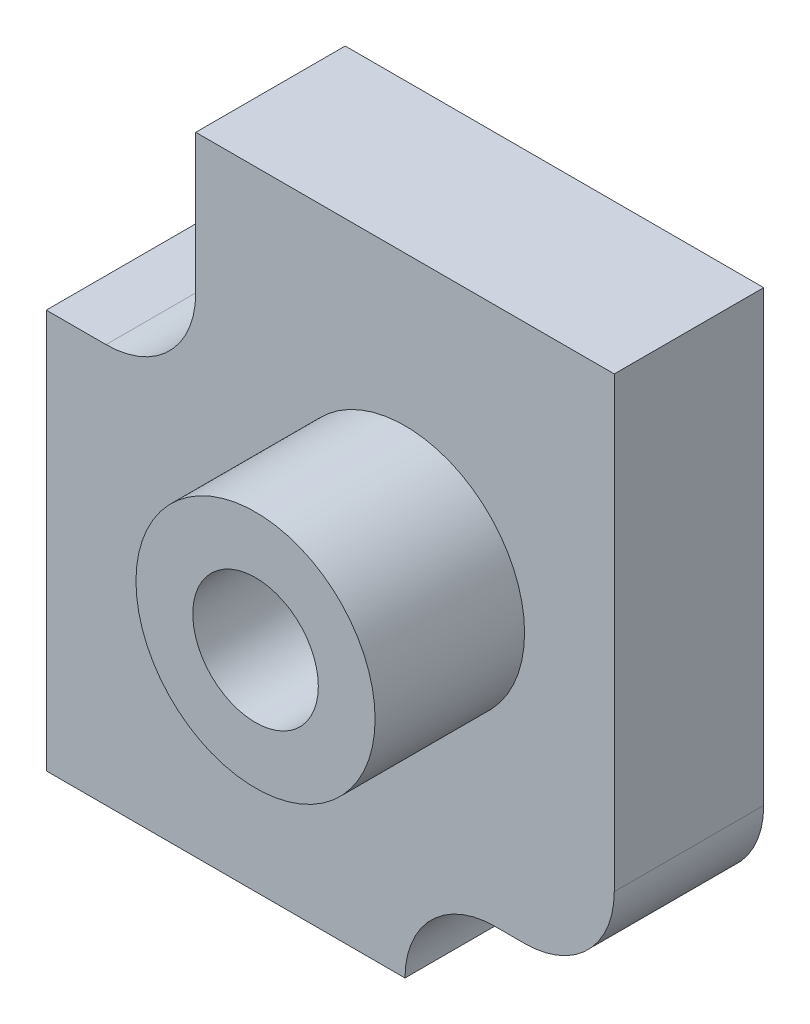
ISO-10303-21;
HEADER;
FILE_DESCRIPTION(('STEP AP214'),'2;1');
FILE_NAME('part.step','',(''),(''),'','','');
FILE_SCHEMA(('AUTOMOTIVE_DESIGN { 1 0 10303 214 1 1 1 1 }'));
ENDSEC;
DATA;
#1=APPLICATION_CONTEXT('core data for automotive mechanical design processes');
#2=APPLICATION_PROTOCOL_DEFINITION('international standard','automotive_design',2000,#1);
#3=PRODUCT_CONTEXT('',#1,'mechanical');
#4=PRODUCT('Part','Part','',(#3));
#5=PRODUCT_RELATED_PRODUCT_CATEGORY('part','',(#4));
#6=PRODUCT_DEFINITION_FORMATION('','',#4);
#7=PRODUCT_DEFINITION_CONTEXT('part definition',#1,'design');
#8=PRODUCT_DEFINITION('design','',#6,#7);
#9=PRODUCT_DEFINITION_SHAPE('','',#8);
#10=(LENGTH_UNIT() NAMED_UNIT(*) SI_UNIT(.MILLI.,.METRE.));
#11=(NAMED_UNIT(*) PLANE_ANGLE_UNIT() SI_UNIT($,.RADIAN.));
#12=(NAMED_UNIT(*) SI_UNIT($,.STERADIAN.) SOLID_ANGLE_UNIT());
#13=UNCERTAINTY_MEASURE_WITH_UNIT(LENGTH_MEASURE(1.E-05),#10,'distance_accuracy_value','');
#14=(GEOMETRIC_REPRESENTATION_CONTEXT(3) GLOBAL_UNCERTAINTY_ASSIGNED_CONTEXT((#13)) GLOBAL_UNIT_ASSIGNED_CONTEXT((#10,
#11,#12)) REPRESENTATION_CONTEXT('',''));
#15=CARTESIAN_POINT('',(0.,0.,0.));
#16=DIRECTION('',(0.,0.,1.));
#17=DIRECTION('',(1.,0.,0.));
#18=AXIS2_PLACEMENT_3D('',#15,#16,#17);
#19=CARTESIAN_POINT('',(-7.,9.,5.));
#20=DIRECTION('',(1.,0.,0.));
#21=DIRECTION('',(0.,0.,-1.));
#22=AXIS2_PLACEMENT_3D('',#19,#20,#21);
#23=PLANE('',#22);
#24=DIRECTION('',(0.,-1.,0.));
#25=VECTOR('',#24,1.);
#26=CARTESIAN_POINT('',(-7.,9.,0.));
#27=LINE('',#26,#25);
#28=CARTESIAN_POINT('',(-7.,9.,0.));
#29=VERTEX_POINT('',#28);
#30=CARTESIAN_POINT('',(-7.,4.34897785434163,0.));
#31=VERTEX_POINT('',#30);
#32=EDGE_CURVE('E154',#29,#31,#27,.T.);
#33=ORIENTED_EDGE('',*,*,#32,.T.);
#34=DIRECTION('',(0.,0.,-1.));
#35=VECTOR('',#34,1.);
#36=CARTESIAN_POINT('',(-7.,4.34897785434163,5.));
#37=LINE('',#36,#35);
#38=CARTESIAN_POINT('',(-7.,4.34897785434163,5.));
#39=VERTEX_POINT('',#38);
#40=EDGE_CURVE('E56',#31,#39,#37,.F.);
#41=ORIENTED_EDGE('',*,*,#40,.T.);
#42=DIRECTION('',(0.,-1.,0.));
#43=VECTOR('',#42,1.);
#44=CARTESIAN_POINT('',(-7.,9.,5.));
#45=LINE('',#44,#43);
#46=CARTESIAN_POINT('',(-7.,9.,5.));
#47=VERTEX_POINT('',#46);
#48=EDGE_CURVE('E157',#47,#39,#45,.T.);
#49=ORIENTED_EDGE('',*,*,#48,.F.);
#50=DIRECTION('',(0.,0.,-1.));
#51=VECTOR('',#50,1.);
#52=CARTESIAN_POINT('',(-7.,9.,5.));
#53=LINE('',#52,#51);
#54=EDGE_CURVE('E166',#47,#29,#53,.T.);
#55=ORIENTED_EDGE('',*,*,#54,.T.);
#56=EDGE_LOOP('',(#33,#41,#49,#55));
#57=FACE_BOUND('',#56,.T.);
#58=ADVANCED_FACE('F33',(#57),#23,.F.);
#59=CARTESIAN_POINT('',(-7.,-9.,5.));
#60=DIRECTION('',(0.,1.,0.));
#61=DIRECTION('',(0.,0.,1.));
#62=AXIS2_PLACEMENT_3D('',#59,#60,#61);
#63=PLANE('',#62);
#64=DIRECTION('',(1.,0.,0.));
#65=VECTOR('',#64,1.);
#66=CARTESIAN_POINT('',(-7.,-9.,0.));
#67=LINE('',#66,#65);
#68=CARTESIAN_POINT('',(3.,-9.,0.));
#69=VERTEX_POINT('',#68);
#70=CARTESIAN_POINT('',(4.,-9.,0.));
#71=VERTEX_POINT('',#70);
#72=EDGE_CURVE('E168',#69,#71,#67,.T.);
#73=ORIENTED_EDGE('',*,*,#72,.T.);
#74=DIRECTION('',(0.,0.,-1.));
#75=VECTOR('',#74,1.);
#76=CARTESIAN_POINT('',(4.,-9.,5.));
#77=LINE('',#76,#75);
#78=CARTESIAN_POINT('',(4.,-9.,5.));
#79=VERTEX_POINT('',#78);
#80=EDGE_CURVE('E187',#71,#79,#77,.F.);
#81=ORIENTED_EDGE('',*,*,#80,.T.);
#82=DIRECTION('',(1.,0.,0.));
#83=VECTOR('',#82,1.);
#84=CARTESIAN_POINT('',(-7.,-9.,5.));
#85=LINE('',#84,#83);
#86=CARTESIAN_POINT('',(3.,-9.,5.));
#87=VERTEX_POINT('',#86);
#88=EDGE_CURVE('E159',#87,#79,#85,.T.);
#89=ORIENTED_EDGE('',*,*,#88,.F.);
#90=DIRECTION('',(0.,0.,-1.));
#91=VECTOR('',#90,1.);
#92=CARTESIAN_POINT('',(3.,-9.,0.));
#93=LINE('',#92,#91);
#94=EDGE_CURVE('E184',#87,#69,#93,.T.);
#95=ORIENTED_EDGE('',*,*,#94,.T.);
#96=EDGE_LOOP('',(#73,#81,#89,#95));
#97=FACE_BOUND('',#96,.T.);
#98=ADVANCED_FACE('F211',(#97),#63,.F.);
#99=CARTESIAN_POINT('',(-7.,-9.,5.));
#100=DIRECTION('',(0.,0.,1.));
#101=DIRECTION('',(1.,0.,0.));
#102=AXIS2_PLACEMENT_3D('',#99,#100,#101);
#103=PLANE('',#102);
#104=ORIENTED_EDGE('',*,*,#88,.T.);
#105=CARTESIAN_POINT('',(4.,-6.,5.));
#106=DIRECTION('',(0.,0.,1.));
#107=DIRECTION('',(1.,0.,0.));
#108=AXIS2_PLACEMENT_3D('',#105,#106,#107);
#109=CIRCLE('',#108,3.);
#110=CARTESIAN_POINT('',(7.,-6.,5.));
#111=VERTEX_POINT('',#110);
#112=EDGE_CURVE('E189',#79,#111,#109,.T.);
#113=ORIENTED_EDGE('',*,*,#112,.T.);
#114=DIRECTION('',(0.,1.,0.));
#115=VECTOR('',#114,1.);
#116=CARTESIAN_POINT('',(7.,9.,5.));
#117=LINE('',#116,#115);
#118=CARTESIAN_POINT('',(7.,9.,5.));
#119=VERTEX_POINT('',#118);
#120=EDGE_CURVE('E162',#111,#119,#117,.T.);
#121=ORIENTED_EDGE('',*,*,#120,.T.);
#122=DIRECTION('',(-1.,0.,0.));
#123=VECTOR('',#122,1.);
#124=CARTESIAN_POINT('',(-7.,9.,5.));
#125=LINE('',#124,#123);
#126=EDGE_CURVE('E164',#119,#47,#125,.T.);
#127=ORIENTED_EDGE('',*,*,#126,.T.);
#128=ORIENTED_EDGE('',*,*,#48,.T.);
#129=CARTESIAN_POINT('',(-10.,4.34897785434163,5.));
#130=DIRECTION('',(0.,0.,1.));
#131=DIRECTION('',(1.,0.,0.));
#132=AXIS2_PLACEMENT_3D('',#129,#130,#131);
#133=CIRCLE('',#132,3.);
#134=CARTESIAN_POINT('',(-10.,1.34897785434163,5.));
#135=VERTEX_POINT('',#134);
#136=EDGE_CURVE('E48',#39,#135,#133,.F.);
#137=ORIENTED_EDGE('',*,*,#136,.T.);
#138=DIRECTION('',(-1.,0.,0.));
#139=VECTOR('',#138,1.);
#140=CARTESIAN_POINT('',(-7.,1.34897785434163,5.));
#141=LINE('',#140,#139);
#142=CARTESIAN_POINT('',(-12.,1.34897785434163,5.));
#143=VERTEX_POINT('',#142);
#144=EDGE_CURVE('E109',#135,#143,#141,.T.);
#145=ORIENTED_EDGE('',*,*,#144,.T.);
#146=DIRECTION('',(0.,-1.,0.));
#147=VECTOR('',#146,1.);
#148=CARTESIAN_POINT('',(-12.,1.34897785434163,5.));
#149=LINE('',#148,#147);
#150=CARTESIAN_POINT('',(-12.,-12.,5.));
#151=VERTEX_POINT('',#150);
#152=EDGE_CURVE('E115',#143,#151,#149,.T.);
#153=ORIENTED_EDGE('',*,*,#152,.T.);
#154=DIRECTION('',(1.,0.,0.));
#155=VECTOR('',#154,1.);
#156=CARTESIAN_POINT('',(-12.,-12.,5.));
#157=LINE('',#156,#155);
#158=CARTESIAN_POINT('',(0.,-12.,5.));
#159=VERTEX_POINT('',#158);
#160=EDGE_CURVE('E130',#151,#159,#157,.T.);
#161=ORIENTED_EDGE('',*,*,#160,.T.);
#162=CARTESIAN_POINT('',(3.,-12.,5.));
#163=DIRECTION('',(0.,0.,1.));
#164=DIRECTION('',(1.,0.,0.));
#165=AXIS2_PLACEMENT_3D('',#162,#163,#164);
#166=CIRCLE('',#165,3.);
#167=EDGE_CURVE('E12',#159,#87,#166,.F.);
#168=ORIENTED_EDGE('',*,*,#167,.T.);
#169=EDGE_LOOP('',(#104,#113,#121,#127,#128,#137,#145,#153,#161,#168));
#170=FACE_BOUND('',#169,.T.);
#171=CARTESIAN_POINT('',(0.,0.,5.));
#172=DIRECTION('',(0.,0.,1.));
#173=DIRECTION('',(1.,0.,0.));
#174=AXIS2_PLACEMENT_3D('',#171,#172,#173);
#175=CIRCLE('',#174,4.);
#176=CARTESIAN_POINT('',(4.,0.,5.));
#177=VERTEX_POINT('',#176);
#178=EDGE_CURVE('E150',#177,#177,#175,.T.);
#179=ORIENTED_EDGE('',*,*,#178,.F.);
#180=EDGE_LOOP('',(#179));
#181=FACE_BOUND('',#180,.T.);
#182=ADVANCED_FACE('F112',(#170,#181),#103,.T.);
#183=CARTESIAN_POINT('',(7.,9.,5.));
#184=DIRECTION('',(-1.,0.,0.));
#185=DIRECTION('',(0.,-1.,0.));
#186=AXIS2_PLACEMENT_3D('',#183,#184,#185);
#187=PLANE('',#186);
#188=ORIENTED_EDGE('',*,*,#120,.F.);
#189=DIRECTION('',(0.,0.,-1.));
#190=VECTOR('',#189,1.);
#191=CARTESIAN_POINT('',(7.,-6.,5.));
#192=LINE('',#191,#190);
#193=CARTESIAN_POINT('',(7.,-6.,0.));
#194=VERTEX_POINT('',#193);
#195=EDGE_CURVE('E179',#111,#194,#192,.T.);
#196=ORIENTED_EDGE('',*,*,#195,.T.);
#197=DIRECTION('',(0.,1.,0.));
#198=VECTOR('',#197,1.);
#199=CARTESIAN_POINT('',(7.,9.,0.));
#200=LINE('',#199,#198);
#201=CARTESIAN_POINT('',(7.,9.,0.));
#202=VERTEX_POINT('',#201);
#203=EDGE_CURVE('E171',#194,#202,#200,.T.);
#204=ORIENTED_EDGE('',*,*,#203,.T.);
#205=DIRECTION('',(0.,0.,-1.));
#206=VECTOR('',#205,1.);
#207=CARTESIAN_POINT('',(7.,9.,5.));
#208=LINE('',#207,#206);
#209=EDGE_CURVE('E176',#119,#202,#208,.T.);
#210=ORIENTED_EDGE('',*,*,#209,.F.);
#211=EDGE_LOOP('',(#188,#196,#204,#210));
#212=FACE_BOUND('',#211,.T.);
#213=ADVANCED_FACE('F219',(#212),#187,.F.);
#214=CARTESIAN_POINT('',(-7.,9.,5.));
#215=DIRECTION('',(0.,-1.,0.));
#216=DIRECTION('',(0.,0.,-1.));
#217=AXIS2_PLACEMENT_3D('',#214,#215,#216);
#218=PLANE('',#217);
#219=DIRECTION('',(-1.,0.,0.));
#220=VECTOR('',#219,1.);
#221=CARTESIAN_POINT('',(-7.,9.,0.));
#222=LINE('',#221,#220);
#223=EDGE_CURVE('E160',#202,#29,#222,.T.);
#224=ORIENTED_EDGE('',*,*,#223,.T.);
#225=ORIENTED_EDGE('',*,*,#54,.F.);
#226=ORIENTED_EDGE('',*,*,#126,.F.);
#227=ORIENTED_EDGE('',*,*,#209,.T.);
#228=EDGE_LOOP('',(#224,#225,#226,#227));
#229=FACE_BOUND('',#228,.T.);
#230=ADVANCED_FACE('F224',(#229),#218,.F.);
#231=CARTESIAN_POINT('',(-7.,-9.,0.));
#232=DIRECTION('',(0.,0.,1.));
#233=DIRECTION('',(1.,0.,0.));
#234=AXIS2_PLACEMENT_3D('',#231,#232,#233);
#235=PLANE('',#234);
#236=ORIENTED_EDGE('',*,*,#203,.F.);
#237=CARTESIAN_POINT('',(4.,-6.,0.));
#238=DIRECTION('',(0.,0.,1.));
#239=DIRECTION('',(1.,0.,0.));
#240=AXIS2_PLACEMENT_3D('',#237,#238,#239);
#241=CIRCLE('',#240,3.);
#242=EDGE_CURVE('E182',#194,#71,#241,.F.);
#243=ORIENTED_EDGE('',*,*,#242,.T.);
#244=ORIENTED_EDGE('',*,*,#72,.F.);
#245=CARTESIAN_POINT('',(3.,-12.,0.));
#246=DIRECTION('',(0.,0.,1.));
#247=DIRECTION('',(1.,0.,0.));
#248=AXIS2_PLACEMENT_3D('',#245,#246,#247);
#249=CIRCLE('',#248,3.);
#250=CARTESIAN_POINT('',(0.,-12.,0.));
#251=VERTEX_POINT('',#250);
#252=EDGE_CURVE('E41',#69,#251,#249,.T.);
#253=ORIENTED_EDGE('',*,*,#252,.T.);
#254=DIRECTION('',(1.,0.,0.));
#255=VECTOR('',#254,1.);
#256=CARTESIAN_POINT('',(-12.,-12.,0.));
#257=LINE('',#256,#255);
#258=CARTESIAN_POINT('',(-12.,-12.,0.));
#259=VERTEX_POINT('',#258);
#260=EDGE_CURVE('E141',#259,#251,#257,.T.);
#261=ORIENTED_EDGE('',*,*,#260,.F.);
#262=DIRECTION('',(0.,-1.,0.));
#263=VECTOR('',#262,1.);
#264=CARTESIAN_POINT('',(-12.,1.34897785434163,0.));
#265=LINE('',#264,#263);
#266=CARTESIAN_POINT('',(-12.,1.34897785434163,0.));
#267=VERTEX_POINT('',#266);
#268=EDGE_CURVE('E135',#267,#259,#265,.T.);
#269=ORIENTED_EDGE('',*,*,#268,.F.);
#270=DIRECTION('',(-1.,0.,0.));
#271=VECTOR('',#270,1.);
#272=CARTESIAN_POINT('',(-7.,1.34897785434163,0.));
#273=LINE('',#272,#271);
#274=CARTESIAN_POINT('',(-10.,1.34897785434163,0.));
#275=VERTEX_POINT('',#274);
#276=EDGE_CURVE('E134',#275,#267,#273,.T.);
#277=ORIENTED_EDGE('',*,*,#276,.F.);
#278=CARTESIAN_POINT('',(-10.,4.34897785434163,0.));
#279=DIRECTION('',(0.,0.,1.));
#280=DIRECTION('',(1.,0.,0.));
#281=AXIS2_PLACEMENT_3D('',#278,#279,#280);
#282=CIRCLE('',#281,3.);
#283=EDGE_CURVE('E194',#275,#31,#282,.T.);
#284=ORIENTED_EDGE('',*,*,#283,.T.);
#285=ORIENTED_EDGE('',*,*,#32,.F.);
#286=ORIENTED_EDGE('',*,*,#223,.F.);
#287=EDGE_LOOP('',(#236,#243,#244,#253,#261,#269,#277,#284,#285,#286));
#288=FACE_BOUND('',#287,.T.);
#289=ADVANCED_FACE('F201',(#288),#235,.F.);
#290=CARTESIAN_POINT('',(0.,0.,10.));
#291=DIRECTION('',(0.,0.,-1.));
#292=DIRECTION('',(-1.,0.,0.));
#293=AXIS2_PLACEMENT_3D('',#290,#291,#292);
#294=CYLINDRICAL_SURFACE('',#293,4.);
#295=CARTESIAN_POINT('',(0.,0.,10.));
#296=DIRECTION('',(0.,0.,1.));
#297=DIRECTION('',(1.,0.,0.));
#298=AXIS2_PLACEMENT_3D('',#295,#296,#297);
#299=CIRCLE('',#298,4.);
#300=CARTESIAN_POINT('',(4.,0.,10.));
#301=VERTEX_POINT('',#300);
#302=EDGE_CURVE('E151',#301,#301,#299,.T.);
#303=ORIENTED_EDGE('',*,*,#302,.F.);
#304=EDGE_LOOP('',(#303));
#305=FACE_BOUND('',#304,.T.);
#306=ORIENTED_EDGE('',*,*,#178,.T.);
#307=EDGE_LOOP('',(#306));
#308=FACE_BOUND('',#307,.T.);
#309=ADVANCED_FACE('F282',(#305,#308),#294,.T.);
#310=CARTESIAN_POINT('',(0.,0.,10.));
#311=DIRECTION('',(0.,0.,1.));
#312=DIRECTION('',(1.,0.,0.));
#313=AXIS2_PLACEMENT_3D('',#310,#311,#312);
#314=PLANE('',#313);
#315=CARTESIAN_POINT('',(0.,0.,10.));
#316=DIRECTION('',(0.,0.,1.));
#317=DIRECTION('',(1.,0.,0.));
#318=AXIS2_PLACEMENT_3D('',#315,#316,#317);
#319=CIRCLE('',#318,2.1);
#320=CARTESIAN_POINT('',(2.1,0.,10.));
#321=VERTEX_POINT('',#320);
#322=EDGE_CURVE('E144',#321,#321,#319,.T.);
#323=ORIENTED_EDGE('',*,*,#322,.F.);
#324=EDGE_LOOP('',(#323));
#325=FACE_BOUND('',#324,.T.);
#326=ORIENTED_EDGE('',*,*,#302,.T.);
#327=EDGE_LOOP('',(#326));
#328=FACE_BOUND('',#327,.T.);
#329=ADVANCED_FACE('F336',(#325,#328),#314,.T.);
#330=CARTESIAN_POINT('',(0.,0.,-5.939696961967));
#331=DIRECTION('',(0.,0.,1.));
#332=DIRECTION('',(1.,0.,0.));
#333=AXIS2_PLACEMENT_3D('',#330,#331,#332);
#334=CYLINDRICAL_SURFACE('',#333,2.1);
#335=CARTESIAN_POINT('',(0.,0.,4.));
#336=DIRECTION('',(0.,0.,1.));
#337=DIRECTION('',(1.,0.,0.));
#338=AXIS2_PLACEMENT_3D('',#335,#336,#337);
#339=CIRCLE('',#338,2.1);
#340=CARTESIAN_POINT('',(2.1,0.,4.));
#341=VERTEX_POINT('',#340);
#342=EDGE_CURVE('E147',#341,#341,#339,.F.);
#343=ORIENTED_EDGE('',*,*,#342,.T.);
#344=EDGE_LOOP('',(#343));
#345=FACE_BOUND('',#344,.T.);
#346=ORIENTED_EDGE('',*,*,#322,.T.);
#347=EDGE_LOOP('',(#346));
#348=FACE_BOUND('',#347,.T.);
#349=ADVANCED_FACE('F326',(#345,#348),#334,.F.);
#350=CARTESIAN_POINT('',(-7.,-9.,4.));
#351=DIRECTION('',(0.,0.,1.));
#352=DIRECTION('',(1.,0.,0.));
#353=AXIS2_PLACEMENT_3D('',#350,#351,#352);
#354=PLANE('',#353);
#355=ORIENTED_EDGE('',*,*,#342,.F.);
#356=EDGE_LOOP('',(#355));
#357=FACE_BOUND('',#356,.T.);
#358=ADVANCED_FACE('F272',(#357),#354,.T.);
#359=CARTESIAN_POINT('',(-7.,1.34897785434163,22.9497969279795));
#360=DIRECTION('',(0.,-1.,0.));
#361=DIRECTION('',(1.,0.,0.));
#362=AXIS2_PLACEMENT_3D('',#359,#360,#361);
#363=PLANE('',#362);
#364=ORIENTED_EDGE('',*,*,#144,.F.);
#365=DIRECTION('',(0.,0.,-1.));
#366=VECTOR('',#365,1.);
#367=CARTESIAN_POINT('',(-10.,1.34897785434163,0.));
#368=LINE('',#367,#366);
#369=EDGE_CURVE('E191',#135,#275,#368,.T.);
#370=ORIENTED_EDGE('',*,*,#369,.T.);
#371=ORIENTED_EDGE('',*,*,#276,.T.);
#372=DIRECTION('',(0.,0.,-1.));
#373=VECTOR('',#372,1.);
#374=CARTESIAN_POINT('',(-12.,1.34897785434163,22.9497969279795));
#375=LINE('',#374,#373);
#376=EDGE_CURVE('E127',#143,#267,#375,.T.);
#377=ORIENTED_EDGE('',*,*,#376,.F.);
#378=EDGE_LOOP('',(#364,#370,#371,#377));
#379=FACE_BOUND('',#378,.T.);
#380=ADVANCED_FACE('F132',(#379),#363,.F.);
#381=CARTESIAN_POINT('',(-12.,1.34897785434163,22.9497969279795));
#382=DIRECTION('',(1.,0.,0.));
#383=DIRECTION('',(0.,1.,0.));
#384=AXIS2_PLACEMENT_3D('',#381,#382,#383);
#385=PLANE('',#384);
#386=ORIENTED_EDGE('',*,*,#152,.F.);
#387=ORIENTED_EDGE('',*,*,#376,.T.);
#388=ORIENTED_EDGE('',*,*,#268,.T.);
#389=DIRECTION('',(0.,0.,-1.));
#390=VECTOR('',#389,1.);
#391=CARTESIAN_POINT('',(-12.,-12.,22.9497969279795));
#392=LINE('',#391,#390);
#393=EDGE_CURVE('E129',#151,#259,#392,.T.);
#394=ORIENTED_EDGE('',*,*,#393,.F.);
#395=EDGE_LOOP('',(#386,#387,#388,#394));
#396=FACE_BOUND('',#395,.T.);
#397=ADVANCED_FACE('F125',(#396),#385,.F.);
#398=CARTESIAN_POINT('',(-12.,-12.,22.9497969279795));
#399=DIRECTION('',(0.,1.,0.));
#400=DIRECTION('',(-1.,0.,0.));
#401=AXIS2_PLACEMENT_3D('',#398,#399,#400);
#402=PLANE('',#401);
#403=ORIENTED_EDGE('',*,*,#160,.F.);
#404=ORIENTED_EDGE('',*,*,#393,.T.);
#405=ORIENTED_EDGE('',*,*,#260,.T.);
#406=DIRECTION('',(0.,0.,-1.));
#407=VECTOR('',#406,1.);
#408=CARTESIAN_POINT('',(0.,-12.,22.9497969279795));
#409=LINE('',#408,#407);
#410=EDGE_CURVE('E120',#159,#251,#409,.T.);
#411=ORIENTED_EDGE('',*,*,#410,.F.);
#412=EDGE_LOOP('',(#403,#404,#405,#411));
#413=FACE_BOUND('',#412,.T.);
#414=ADVANCED_FACE('F205',(#413),#402,.F.);
#415=CARTESIAN_POINT('',(4.,-6.,5.));
#416=DIRECTION('',(0.,0.,-1.));
#417=DIRECTION('',(-1.,0.,0.));
#418=AXIS2_PLACEMENT_3D('',#415,#416,#417);
#419=CYLINDRICAL_SURFACE('',#418,3.);
#420=ORIENTED_EDGE('',*,*,#112,.F.);
#421=ORIENTED_EDGE('',*,*,#80,.F.);
#422=ORIENTED_EDGE('',*,*,#242,.F.);
#423=ORIENTED_EDGE('',*,*,#195,.F.);
#424=EDGE_LOOP('',(#420,#421,#422,#423));
#425=FACE_BOUND('',#424,.T.);
#426=ADVANCED_FACE('F214',(#425),#419,.T.);
#427=CARTESIAN_POINT('',(-10.,4.34897785434163,22.9497969279795));
#428=DIRECTION('',(0.,0.,1.));
#429=DIRECTION('',(1.,0.,0.));
#430=AXIS2_PLACEMENT_3D('',#427,#428,#429);
#431=CYLINDRICAL_SURFACE('',#430,3.);
#432=ORIENTED_EDGE('',*,*,#136,.F.);
#433=ORIENTED_EDGE('',*,*,#40,.F.);
#434=ORIENTED_EDGE('',*,*,#283,.F.);
#435=ORIENTED_EDGE('',*,*,#369,.F.);
#436=EDGE_LOOP('',(#432,#433,#434,#435));
#437=FACE_BOUND('',#436,.T.);
#438=ADVANCED_FACE('F226',(#437),#431,.F.);
#439=CARTESIAN_POINT('',(3.,-12.,5.));
#440=DIRECTION('',(0.,0.,1.));
#441=DIRECTION('',(1.,0.,0.));
#442=AXIS2_PLACEMENT_3D('',#439,#440,#441);
#443=CYLINDRICAL_SURFACE('',#442,3.);
#444=ORIENTED_EDGE('',*,*,#167,.F.);
#445=ORIENTED_EDGE('',*,*,#410,.T.);
#446=ORIENTED_EDGE('',*,*,#252,.F.);
#447=ORIENTED_EDGE('',*,*,#94,.F.);
#448=EDGE_LOOP('',(#444,#445,#446,#447));
#449=FACE_BOUND('',#448,.T.);
#450=ADVANCED_FACE('F35',(#449),#443,.F.);
#451=CLOSED_SHELL('',(#58,#98,#182,#213,#230,#289,#309,#329,#349,#358,#380,#397,#414,#426,#438,#450));
#452=MANIFOLD_SOLID_BREP('B2',#451);
#453=ADVANCED_BREP_SHAPE_REPRESENTATION('',(#18,#452),#14);
#454=SHAPE_DEFINITION_REPRESENTATION(#9,#453);
ENDSEC;
END-ISO-10303-21;
